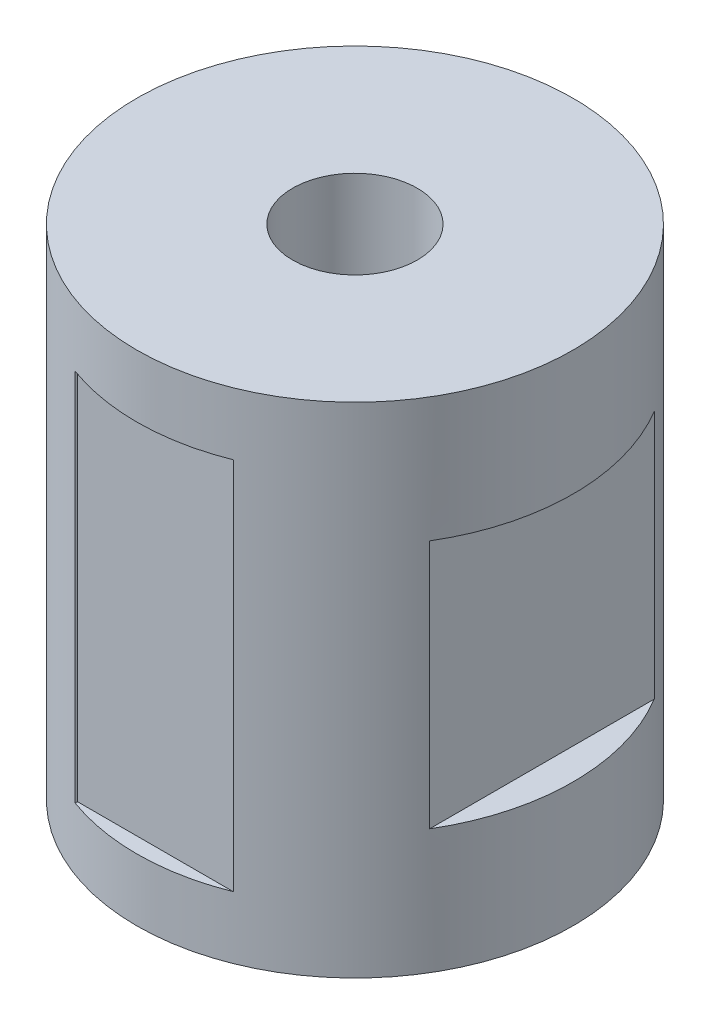
ISO-10303-21;
HEADER;
FILE_DESCRIPTION(('STEP AP214'),'2;1');
FILE_NAME('part.step','',(''),(''),'','','');
FILE_SCHEMA(('AUTOMOTIVE_DESIGN { 1 0 10303 214 1 1 1 1 }'));
ENDSEC;
DATA;
#1=APPLICATION_CONTEXT('core data for automotive mechanical design processes');
#2=APPLICATION_PROTOCOL_DEFINITION('international standard','automotive_design',2000,#1);
#3=PRODUCT_CONTEXT('',#1,'mechanical');
#4=PRODUCT('Part','Part','',(#3));
#5=PRODUCT_RELATED_PRODUCT_CATEGORY('part','',(#4));
#6=PRODUCT_DEFINITION_FORMATION('','',#4);
#7=PRODUCT_DEFINITION_CONTEXT('part definition',#1,'design');
#8=PRODUCT_DEFINITION('design','',#6,#7);
#9=PRODUCT_DEFINITION_SHAPE('','',#8);
#10=(LENGTH_UNIT() NAMED_UNIT(*) SI_UNIT(.MILLI.,.METRE.));
#11=(NAMED_UNIT(*) PLANE_ANGLE_UNIT() SI_UNIT($,.RADIAN.));
#12=(NAMED_UNIT(*) SI_UNIT($,.STERADIAN.) SOLID_ANGLE_UNIT());
#13=UNCERTAINTY_MEASURE_WITH_UNIT(LENGTH_MEASURE(1.E-05),#10,'distance_accuracy_value','');
#14=(GEOMETRIC_REPRESENTATION_CONTEXT(3) GLOBAL_UNCERTAINTY_ASSIGNED_CONTEXT((#13)) GLOBAL_UNIT_ASSIGNED_CONTEXT((#10,
#11,#12)) REPRESENTATION_CONTEXT('',''));
#15=CARTESIAN_POINT('',(0.,0.,0.));
#16=DIRECTION('',(0.,0.,1.));
#17=DIRECTION('',(1.,0.,0.));
#18=AXIS2_PLACEMENT_3D('',#15,#16,#17);
#19=CARTESIAN_POINT('',(0.,800.,0.));
#20=DIRECTION('',(0.,-1.,0.));
#21=DIRECTION('',(0.,0.,-1.));
#22=AXIS2_PLACEMENT_3D('',#19,#20,#21);
#23=CYLINDRICAL_SURFACE('',#22,350.);
#24=DIRECTION('',(0.,-1.,0.));
#25=VECTOR('',#24,1.);
#26=CARTESIAN_POINT('',(300.,800.,-180.277563773199));
#27=LINE('',#26,#25);
#28=CARTESIAN_POINT('',(300.,600.,-180.277563773199));
#29=VERTEX_POINT('',#28);
#30=CARTESIAN_POINT('',(300.,200.,-180.277563773199));
#31=VERTEX_POINT('',#30);
#32=EDGE_CURVE('E11',#29,#31,#27,.T.);
#33=ORIENTED_EDGE('',*,*,#32,.T.);
#34=CARTESIAN_POINT('',(0.,200.,0.));
#35=DIRECTION('',(0.,-1.,0.));
#36=DIRECTION('',(0.,0.,-1.));
#37=AXIS2_PLACEMENT_3D('',#34,#35,#36);
#38=CIRCLE('',#37,350.);
#39=CARTESIAN_POINT('',(300.,200.,180.277563773199));
#40=VERTEX_POINT('',#39);
#41=EDGE_CURVE('E89',#31,#40,#38,.T.);
#42=ORIENTED_EDGE('',*,*,#41,.T.);
#43=DIRECTION('',(0.,-1.,0.));
#44=VECTOR('',#43,1.);
#45=CARTESIAN_POINT('',(300.,800.,180.277563773199));
#46=LINE('',#45,#44);
#47=CARTESIAN_POINT('',(300.,600.,180.277563773199));
#48=VERTEX_POINT('',#47);
#49=EDGE_CURVE('E41',#40,#48,#46,.F.);
#50=ORIENTED_EDGE('',*,*,#49,.T.);
#51=CARTESIAN_POINT('',(0.,600.,0.));
#52=DIRECTION('',(0.,1.,0.));
#53=DIRECTION('',(0.,0.,1.));
#54=AXIS2_PLACEMENT_3D('',#51,#52,#53);
#55=CIRCLE('',#54,350.);
#56=EDGE_CURVE('E47',#48,#29,#55,.T.);
#57=ORIENTED_EDGE('',*,*,#56,.T.);
#58=EDGE_LOOP('',(#33,#42,#50,#57));
#59=FACE_BOUND('',#58,.T.);
#60=CARTESIAN_POINT('',(0.,0.,0.));
#61=DIRECTION('',(0.,1.,0.));
#62=DIRECTION('',(0.,0.,1.));
#63=AXIS2_PLACEMENT_3D('',#60,#61,#62);
#64=CIRCLE('',#63,350.);
#65=CARTESIAN_POINT('',(0.,0.,350.));
#66=VERTEX_POINT('',#65);
#67=EDGE_CURVE('E108',#66,#66,#64,.T.);
#68=ORIENTED_EDGE('',*,*,#67,.T.);
#69=EDGE_LOOP('',(#68));
#70=FACE_BOUND('',#69,.T.);
#71=CARTESIAN_POINT('',(0.,800.,0.));
#72=DIRECTION('',(0.,1.,0.));
#73=DIRECTION('',(0.,0.,1.));
#74=AXIS2_PLACEMENT_3D('',#71,#72,#73);
#75=CIRCLE('',#74,350.);
#76=CARTESIAN_POINT('',(0.,800.,350.));
#77=VERTEX_POINT('',#76);
#78=EDGE_CURVE('E107',#77,#77,#75,.T.);
#79=ORIENTED_EDGE('',*,*,#78,.F.);
#80=EDGE_LOOP('',(#79));
#81=FACE_BOUND('',#80,.T.);
#82=CARTESIAN_POINT('',(0.,700.,0.));
#83=DIRECTION('',(0.,-1.,0.));
#84=DIRECTION('',(0.,0.,-1.));
#85=AXIS2_PLACEMENT_3D('',#82,#83,#84);
#86=CIRCLE('',#85,350.);
#87=CARTESIAN_POINT('',(129.903810567666,700.,325.));
#88=VERTEX_POINT('',#87);
#89=CARTESIAN_POINT('',(-120.,700.,328.785644455472));
#90=VERTEX_POINT('',#89);
#91=EDGE_CURVE('E104',#88,#90,#86,.T.);
#92=ORIENTED_EDGE('',*,*,#91,.F.);
#93=DIRECTION('',(0.,-1.,0.));
#94=VECTOR('',#93,1.);
#95=CARTESIAN_POINT('',(129.903810567666,800.,325.));
#96=LINE('',#95,#94);
#97=CARTESIAN_POINT('',(129.903810567666,100.,325.));
#98=VERTEX_POINT('',#97);
#99=EDGE_CURVE('E96',#98,#88,#96,.F.);
#100=ORIENTED_EDGE('',*,*,#99,.F.);
#101=CARTESIAN_POINT('',(0.,100.,0.));
#102=DIRECTION('',(0.,-1.,0.));
#103=DIRECTION('',(0.,0.,-1.));
#104=AXIS2_PLACEMENT_3D('',#101,#102,#103);
#105=CIRCLE('',#104,350.);
#106=CARTESIAN_POINT('',(-120.,100.,328.785644455472));
#107=VERTEX_POINT('',#106);
#108=EDGE_CURVE('E55',#98,#107,#105,.T.);
#109=ORIENTED_EDGE('',*,*,#108,.T.);
#110=DIRECTION('',(0.,-1.,0.));
#111=VECTOR('',#110,1.);
#112=CARTESIAN_POINT('',(-120.,800.,328.785644455472));
#113=LINE('',#112,#111);
#114=EDGE_CURVE('E101',#107,#90,#113,.F.);
#115=ORIENTED_EDGE('',*,*,#114,.T.);
#116=EDGE_LOOP('',(#92,#100,#109,#115));
#117=FACE_BOUND('',#116,.T.);
#118=ADVANCED_FACE('F33',(#59,#70,#81,#117),#23,.T.);
#119=CARTESIAN_POINT('',(0.,800.,0.));
#120=DIRECTION('',(0.,-1.,0.));
#121=DIRECTION('',(0.,0.,-1.));
#122=AXIS2_PLACEMENT_3D('',#119,#120,#121);
#123=CYLINDRICAL_SURFACE('',#122,100.);
#124=CARTESIAN_POINT('',(0.,800.,0.));
#125=DIRECTION('',(0.,1.,0.));
#126=DIRECTION('',(0.,0.,1.));
#127=AXIS2_PLACEMENT_3D('',#124,#125,#126);
#128=CIRCLE('',#127,100.);
#129=CARTESIAN_POINT('',(0.,800.,100.));
#130=VERTEX_POINT('',#129);
#131=EDGE_CURVE('E111',#130,#130,#128,.T.);
#132=ORIENTED_EDGE('',*,*,#131,.T.);
#133=EDGE_LOOP('',(#132));
#134=FACE_BOUND('',#133,.T.);
#135=CARTESIAN_POINT('',(0.,0.,0.));
#136=DIRECTION('',(0.,1.,0.));
#137=DIRECTION('',(0.,0.,1.));
#138=AXIS2_PLACEMENT_3D('',#135,#136,#137);
#139=CIRCLE('',#138,100.);
#140=CARTESIAN_POINT('',(0.,0.,100.));
#141=VERTEX_POINT('',#140);
#142=EDGE_CURVE('E112',#141,#141,#139,.T.);
#143=ORIENTED_EDGE('',*,*,#142,.F.);
#144=EDGE_LOOP('',(#143));
#145=FACE_BOUND('',#144,.T.);
#146=ADVANCED_FACE('F35',(#134,#145),#123,.F.);
#147=CARTESIAN_POINT('',(0.,800.,0.));
#148=DIRECTION('',(0.,1.,0.));
#149=DIRECTION('',(0.,0.,1.));
#150=AXIS2_PLACEMENT_3D('',#147,#148,#149);
#151=PLANE('',#150);
#152=ORIENTED_EDGE('',*,*,#131,.F.);
#153=EDGE_LOOP('',(#152));
#154=FACE_BOUND('',#153,.T.);
#155=ORIENTED_EDGE('',*,*,#78,.T.);
#156=EDGE_LOOP('',(#155));
#157=FACE_BOUND('',#156,.T.);
#158=ADVANCED_FACE('F154',(#154,#157),#151,.T.);
#159=CARTESIAN_POINT('',(0.,0.,0.));
#160=DIRECTION('',(0.,1.,0.));
#161=DIRECTION('',(0.,0.,1.));
#162=AXIS2_PLACEMENT_3D('',#159,#160,#161);
#163=PLANE('',#162);
#164=ORIENTED_EDGE('',*,*,#142,.T.);
#165=EDGE_LOOP('',(#164));
#166=FACE_BOUND('',#165,.T.);
#167=ORIENTED_EDGE('',*,*,#67,.F.);
#168=EDGE_LOOP('',(#167));
#169=FACE_BOUND('',#168,.T.);
#170=ADVANCED_FACE('F157',(#166,#169),#163,.F.);
#171=CARTESIAN_POINT('',(-120.,700.,325.));
#172=DIRECTION('',(-1.,0.,0.));
#173=DIRECTION('',(0.,-1.,0.));
#174=AXIS2_PLACEMENT_3D('',#171,#172,#173);
#175=PLANE('',#174);
#176=DIRECTION('',(0.,0.,1.));
#177=VECTOR('',#176,1.);
#178=CARTESIAN_POINT('',(-120.,100.,325.));
#179=LINE('',#178,#177);
#180=CARTESIAN_POINT('',(-120.,100.,325.));
#181=VERTEX_POINT('',#180);
#182=EDGE_CURVE('E120',#181,#107,#179,.T.);
#183=ORIENTED_EDGE('',*,*,#182,.F.);
#184=DIRECTION('',(0.,-1.,0.));
#185=VECTOR('',#184,1.);
#186=CARTESIAN_POINT('',(-120.,700.,325.));
#187=LINE('',#186,#185);
#188=CARTESIAN_POINT('',(-120.,700.,325.));
#189=VERTEX_POINT('',#188);
#190=EDGE_CURVE('E92',#189,#181,#187,.T.);
#191=ORIENTED_EDGE('',*,*,#190,.F.);
#192=DIRECTION('',(0.,0.,1.));
#193=VECTOR('',#192,1.);
#194=CARTESIAN_POINT('',(-120.,700.,325.));
#195=LINE('',#194,#193);
#196=EDGE_CURVE('E115',#189,#90,#195,.T.);
#197=ORIENTED_EDGE('',*,*,#196,.T.);
#198=ORIENTED_EDGE('',*,*,#114,.F.);
#199=EDGE_LOOP('',(#183,#191,#197,#198));
#200=FACE_BOUND('',#199,.T.);
#201=ADVANCED_FACE('F137',(#200),#175,.F.);
#202=CARTESIAN_POINT('',(-120.,700.,325.));
#203=DIRECTION('',(0.,-1.,0.));
#204=DIRECTION('',(0.,0.,-1.));
#205=AXIS2_PLACEMENT_3D('',#202,#203,#204);
#206=PLANE('',#205);
#207=DIRECTION('',(1.,0.,0.));
#208=VECTOR('',#207,1.);
#209=CARTESIAN_POINT('',(-120.,700.,325.));
#210=LINE('',#209,#208);
#211=EDGE_CURVE('E122',#189,#88,#210,.T.);
#212=ORIENTED_EDGE('',*,*,#211,.T.);
#213=ORIENTED_EDGE('',*,*,#91,.T.);
#214=ORIENTED_EDGE('',*,*,#196,.F.);
#215=EDGE_LOOP('',(#212,#213,#214));
#216=FACE_BOUND('',#215,.T.);
#217=ADVANCED_FACE('F140',(#216),#206,.T.);
#218=CARTESIAN_POINT('',(-120.,100.,325.));
#219=DIRECTION('',(0.,-1.,0.));
#220=DIRECTION('',(0.,0.,-1.));
#221=AXIS2_PLACEMENT_3D('',#218,#219,#220);
#222=PLANE('',#221);
#223=DIRECTION('',(1.,0.,0.));
#224=VECTOR('',#223,1.);
#225=CARTESIAN_POINT('',(-120.,100.,325.));
#226=LINE('',#225,#224);
#227=EDGE_CURVE('E127',#181,#98,#226,.T.);
#228=ORIENTED_EDGE('',*,*,#227,.F.);
#229=ORIENTED_EDGE('',*,*,#182,.T.);
#230=ORIENTED_EDGE('',*,*,#108,.F.);
#231=EDGE_LOOP('',(#228,#229,#230));
#232=FACE_BOUND('',#231,.T.);
#233=ADVANCED_FACE('F138',(#232),#222,.F.);
#234=CARTESIAN_POINT('',(0.,0.,325.));
#235=DIRECTION('',(0.,0.,1.));
#236=DIRECTION('',(1.,0.,0.));
#237=AXIS2_PLACEMENT_3D('',#234,#235,#236);
#238=PLANE('',#237);
#239=ORIENTED_EDGE('',*,*,#99,.T.);
#240=ORIENTED_EDGE('',*,*,#211,.F.);
#241=ORIENTED_EDGE('',*,*,#190,.T.);
#242=ORIENTED_EDGE('',*,*,#227,.T.);
#243=EDGE_LOOP('',(#239,#240,#241,#242));
#244=FACE_BOUND('',#243,.T.);
#245=ADVANCED_FACE('F134',(#244),#238,.T.);
#246=CARTESIAN_POINT('',(300.,200.,-180.3));
#247=DIRECTION('',(0.,-1.,0.));
#248=DIRECTION('',(0.,0.,-1.));
#249=AXIS2_PLACEMENT_3D('',#246,#247,#248);
#250=PLANE('',#249);
#251=DIRECTION('',(0.,0.,-1.));
#252=VECTOR('',#251,1.);
#253=CARTESIAN_POINT('',(300.,200.,-180.3));
#254=LINE('',#253,#252);
#255=EDGE_CURVE('E85',#40,#31,#254,.T.);
#256=ORIENTED_EDGE('',*,*,#255,.F.);
#257=ORIENTED_EDGE('',*,*,#41,.F.);
#258=EDGE_LOOP('',(#256,#257));
#259=FACE_BOUND('',#258,.T.);
#260=ADVANCED_FACE('F91',(#259),#250,.F.);
#261=CARTESIAN_POINT('',(300.,600.,-180.3));
#262=DIRECTION('',(0.,1.,0.));
#263=DIRECTION('',(0.,0.,1.));
#264=AXIS2_PLACEMENT_3D('',#261,#262,#263);
#265=PLANE('',#264);
#266=DIRECTION('',(0.,0.,1.));
#267=VECTOR('',#266,1.);
#268=CARTESIAN_POINT('',(300.,600.,-180.3));
#269=LINE('',#268,#267);
#270=EDGE_CURVE('E86',#29,#48,#269,.T.);
#271=ORIENTED_EDGE('',*,*,#270,.F.);
#272=ORIENTED_EDGE('',*,*,#56,.F.);
#273=EDGE_LOOP('',(#271,#272));
#274=FACE_BOUND('',#273,.T.);
#275=ADVANCED_FACE('F196',(#274),#265,.F.);
#276=CARTESIAN_POINT('',(300.,0.,0.));
#277=DIRECTION('',(-1.,0.,0.));
#278=DIRECTION('',(0.,0.,1.));
#279=AXIS2_PLACEMENT_3D('',#276,#277,#278);
#280=PLANE('',#279);
#281=ORIENTED_EDGE('',*,*,#270,.T.);
#282=ORIENTED_EDGE('',*,*,#49,.F.);
#283=ORIENTED_EDGE('',*,*,#255,.T.);
#284=ORIENTED_EDGE('',*,*,#32,.F.);
#285=EDGE_LOOP('',(#281,#282,#283,#284));
#286=FACE_BOUND('',#285,.T.);
#287=ADVANCED_FACE('F84',(#286),#280,.F.);
#288=CLOSED_SHELL('',(#118,#146,#158,#170,#201,#217,#233,#245,#260,#275,#287));
#289=MANIFOLD_SOLID_BREP('B2',#288);
#290=ADVANCED_BREP_SHAPE_REPRESENTATION('',(#18,#289),#14);
#291=SHAPE_DEFINITION_REPRESENTATION(#9,#290);
ENDSEC;
END-ISO-10303-21;
